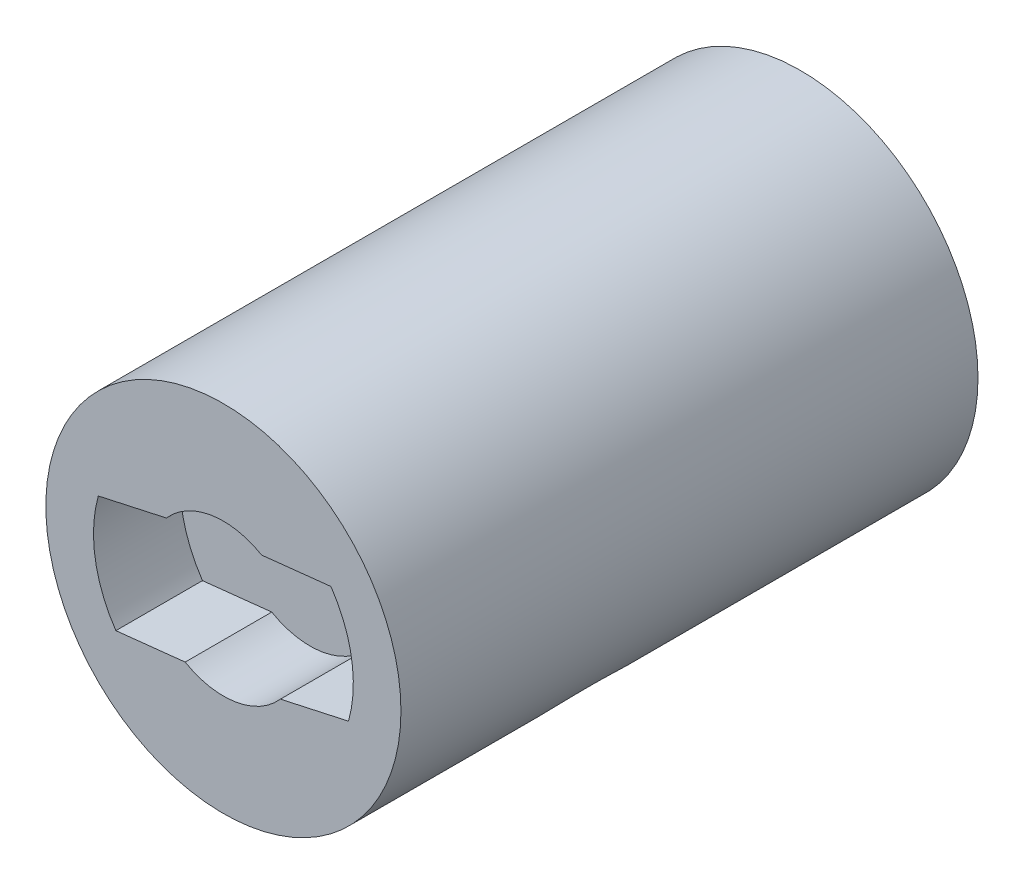
ISO-10303-21;
HEADER;
FILE_DESCRIPTION(('STEP AP214'),'2;1');
FILE_NAME('part.step','',(''),(''),'','','');
FILE_SCHEMA(('AUTOMOTIVE_DESIGN { 1 0 10303 214 1 1 1 1 }'));
ENDSEC;
DATA;
#1=APPLICATION_CONTEXT('core data for automotive mechanical design processes');
#2=APPLICATION_PROTOCOL_DEFINITION('international standard','automotive_design',2000,#1);
#3=PRODUCT_CONTEXT('',#1,'mechanical');
#4=PRODUCT('Part','Part','',(#3));
#5=PRODUCT_RELATED_PRODUCT_CATEGORY('part','',(#4));
#6=PRODUCT_DEFINITION_FORMATION('','',#4);
#7=PRODUCT_DEFINITION_CONTEXT('part definition',#1,'design');
#8=PRODUCT_DEFINITION('design','',#6,#7);
#9=PRODUCT_DEFINITION_SHAPE('','',#8);
#10=(LENGTH_UNIT() NAMED_UNIT(*) SI_UNIT(.MILLI.,.METRE.));
#11=(NAMED_UNIT(*) PLANE_ANGLE_UNIT() SI_UNIT($,.RADIAN.));
#12=(NAMED_UNIT(*) SI_UNIT($,.STERADIAN.) SOLID_ANGLE_UNIT());
#13=UNCERTAINTY_MEASURE_WITH_UNIT(LENGTH_MEASURE(1.E-05),#10,'distance_accuracy_value','');
#14=(GEOMETRIC_REPRESENTATION_CONTEXT(3) GLOBAL_UNCERTAINTY_ASSIGNED_CONTEXT((#13)) GLOBAL_UNIT_ASSIGNED_CONTEXT((#10,
#11,#12)) REPRESENTATION_CONTEXT('',''));
#15=CARTESIAN_POINT('',(0.,0.,0.));
#16=DIRECTION('',(0.,0.,1.));
#17=DIRECTION('',(1.,0.,0.));
#18=AXIS2_PLACEMENT_3D('',#15,#16,#17);
#19=CARTESIAN_POINT('',(0.,0.,26.65));
#20=DIRECTION('',(0.,0.,-1.));
#21=DIRECTION('',(-1.,0.,0.));
#22=AXIS2_PLACEMENT_3D('',#19,#20,#21);
#23=CYLINDRICAL_SURFACE('',#22,8.2);
#24=CARTESIAN_POINT('',(0.,-8.2,22.25));
#25=CARTESIAN_POINT('',(0.15207240943795,-8.19999954792853,22.2499995326064));
#26=CARTESIAN_POINT('',(0.30415176714083,-8.1957606064679,22.2444410540027));
#27=CARTESIAN_POINT('',(0.607097631520944,-8.1789034982446,22.2222996805101));
#28=CARTESIAN_POINT('',(0.757963568944236,-8.16628160717114,22.2057118855999));
#29=CARTESIAN_POINT('',(1.05742056670107,-8.13293249924799,22.1617607942547));
#30=CARTESIAN_POINT('',(1.20600813579783,-8.11219392764066,22.1343824020317));
#31=CARTESIAN_POINT('',(1.49966587575886,-8.06307510113337,22.0692780386894));
#32=CARTESIAN_POINT('',(1.64473446647066,-8.03469148011223,22.0315475093791));
#33=CARTESIAN_POINT('',(1.92944733911106,-7.97109576596842,21.9465669241785));
#34=CARTESIAN_POINT('',(2.06912055366007,-7.93592885894556,21.8993797855473));
#35=CARTESIAN_POINT('',(2.34331893573034,-7.85933555094022,21.7959345656284));
#36=CARTESIAN_POINT('',(2.47784203764071,-7.81790667069163,21.7396728909186));
#37=CARTESIAN_POINT('',(2.87259268776154,-7.68538052883103,21.5582768026148));
#38=CARTESIAN_POINT('',(3.12432748262662,-7.58596836000395,21.4204321600938));
#39=CARTESIAN_POINT('',(3.6240317320613,-7.36128140873211,21.1014679853548));
#40=CARTESIAN_POINT('',(3.86945750051817,-7.2344588642798,20.9175104630975));
#41=CARTESIAN_POINT('',(4.32809144808219,-6.96977258600071,20.5191304380454));
#42=CARTESIAN_POINT('',(4.54125102714886,-6.83189266586798,20.3046629045619));
#43=CARTESIAN_POINT('',(4.85631076880608,-6.60889459824286,19.9385142783027));
#44=CARTESIAN_POINT('',(4.96891350944167,-6.52443515642756,19.7954699450571));
#45=CARTESIAN_POINT('',(5.18161323613211,-6.35682280931943,19.4995150990882));
#46=CARTESIAN_POINT('',(5.28170635571986,-6.27367031488554,19.3466015580312));
#47=CARTESIAN_POINT('',(5.46881333541151,-6.11125303504383,19.0311979385561));
#48=CARTESIAN_POINT('',(5.55583882977753,-6.03198483427953,18.8687165601185));
#49=CARTESIAN_POINT('',(5.71617077204758,-5.88026934168507,18.5342270364932));
#50=CARTESIAN_POINT('',(5.78948507097844,-5.80781815831571,18.3622244167458));
#51=CARTESIAN_POINT('',(5.94111269323296,-5.65315307666194,17.9558962214453));
#52=CARTESIAN_POINT('',(6.01442974417624,-5.57444258488535,17.7182473924686));
#53=CARTESIAN_POINT('',(6.10338369430488,-5.47637318985903,17.3516722556073));
#54=CARTESIAN_POINT('',(6.12952216296965,-5.44702755500472,17.2278729809812));
#55=CARTESIAN_POINT('',(6.17441149032549,-5.39609084647169,16.9773972243255));
#56=CARTESIAN_POINT('',(6.1931662310493,-5.37449569846417,16.850722291341));
#57=CARTESIAN_POINT('',(6.22307192154754,-5.33984190723959,16.593934042489));
#58=CARTESIAN_POINT('',(6.23414096164082,-5.32687528062269,16.4637985893017));
#59=CARTESIAN_POINT('',(6.24808904956325,-5.31050851296349,16.202485094783));
#60=CARTESIAN_POINT('',(6.25096840570315,-5.30710801179267,16.0713070928859));
#61=CARTESIAN_POINT('',(6.2484596035836,-5.31006201799965,15.8091126451263));
#62=CARTESIAN_POINT('',(6.24306989416547,-5.31641835562129,15.6780962341902));
#63=CARTESIAN_POINT('',(6.22416826284947,-5.33853226654295,15.4174853136025));
#64=CARTESIAN_POINT('',(6.21065629899878,-5.35428988840221,15.2878908112989));
#65=CARTESIAN_POINT('',(6.16251570824301,-5.40977436310698,14.9332705039217));
#66=CARTESIAN_POINT('',(6.11964206402348,-5.45861621863641,14.7107283223776));
#67=CARTESIAN_POINT('',(6.01193821916911,-5.57699702233773,14.2768374051819));
#68=CARTESIAN_POINT('',(5.9470852604164,-5.64655741409391,14.0655005352496));
#69=CARTESIAN_POINT('',(5.81093785930049,-5.78625699320936,13.6918129656489));
#70=CARTESIAN_POINT('',(5.74281801885289,-5.85411217780771,13.5274150431297));
#71=CARTESIAN_POINT('',(5.59411549879377,-5.99637044617399,13.2072323159294));
#72=CARTESIAN_POINT('',(5.51352610059914,-6.07077705047013,13.0514522163111));
#73=CARTESIAN_POINT('',(5.3403702702425,-6.22364988437177,12.7483111986112));
#74=CARTESIAN_POINT('',(5.24777880919027,-6.30212438589883,12.6009688291602));
#75=CARTESIAN_POINT('',(5.05117566429857,-6.46077249365511,12.3151384023431));
#76=CARTESIAN_POINT('',(4.94716585339579,-6.54094581949259,12.1766488987325));
#77=CARTESIAN_POINT('',(4.72469664541101,-6.70349045932973,11.9046957616381));
#78=CARTESIAN_POINT('',(4.60589871692113,-6.78585598271882,11.7715053643385));
#79=CARTESIAN_POINT('',(4.35663140803743,-6.94851891245478,11.515111035778));
#80=CARTESIAN_POINT('',(4.22616084680314,-7.02881610850246,11.3919081172907));
#81=CARTESIAN_POINT('',(3.95400328962919,-7.18543430335675,11.1563769688712));
#82=CARTESIAN_POINT('',(3.81233681597405,-7.26176217074497,11.0440296440465));
#83=CARTESIAN_POINT('',(3.51784587452043,-7.4089031762104,10.8308322471403));
#84=CARTESIAN_POINT('',(3.36502042340106,-7.47971582715177,10.7299831902883));
#85=CARTESIAN_POINT('',(3.07875259210313,-7.60135999362749,10.5588539485466));
#86=CARTESIAN_POINT('',(2.94713190504797,-7.65343382576303,10.4864038268094));
#87=CARTESIAN_POINT('',(2.67732507603579,-7.75193808379696,10.3504656234087));
#88=CARTESIAN_POINT('',(2.53914027913725,-7.79836965897692,10.2869757161964));
#89=CARTESIAN_POINT('',(2.25676639811907,-7.88471929521927,10.1696591269519));
#90=CARTESIAN_POINT('',(2.11257800366784,-7.92463810186449,10.115831338728));
#91=CARTESIAN_POINT('',(1.8189996704779,-7.99712992183176,10.0185588160068));
#92=CARTESIAN_POINT('',(1.66961192813028,-8.02970599453324,9.97510975671808));
#93=CARTESIAN_POINT('',(1.3654704218416,-8.08700198983024,9.89895620530778));
#94=CARTESIAN_POINT('',(1.2106861634064,-8.11166468013989,9.86632993237618));
#95=CARTESIAN_POINT('',(0.897957716572402,-8.15221004230744,9.81280885635111));
#96=CARTESIAN_POINT('',(0.740013517079047,-8.168092683333,9.79191409445445));
#97=CARTESIAN_POINT('',(0.422403255466232,-8.1906599365015,9.76225177254438));
#98=CARTESIAN_POINT('',(0.262737976248936,-8.19734856656097,9.75347891507364));
#99=CARTESIAN_POINT('',(-0.056904763303433,-8.20135969627796,9.74821589223887));
#100=CARTESIAN_POINT('',(-0.21688219297588,-8.19868307374172,9.75172457572457));
#101=CARTESIAN_POINT('',(-0.518009077367297,-8.18485266817981,9.76988432167628));
#102=CARTESIAN_POINT('',(-0.659282996368986,-8.17466975240149,9.78325939227514));
#103=CARTESIAN_POINT('',(-0.939958121925078,-8.14716923241113,9.81946559075498));
#104=CARTESIAN_POINT('',(-1.07935869371065,-8.12984926982501,9.84229984435267));
#105=CARTESIAN_POINT('',(-1.35528146304295,-8.08842829935026,9.8970913897884));
#106=CARTESIAN_POINT('',(-1.49180441258411,-8.06432908726929,9.92904626562723));
#107=CARTESIAN_POINT('',(-1.76126464109105,-8.0097973816356,10.0016728221608));
#108=CARTESIAN_POINT('',(-1.89420050535946,-7.97936242942967,10.0423478870036));
#109=CARTESIAN_POINT('',(-2.1588606387946,-7.91191521923912,10.1329869645835));
#110=CARTESIAN_POINT('',(-2.2904822363368,-7.874764661783,10.1831475795288));
#111=CARTESIAN_POINT('',(-2.5486748971823,-7.79503298383987,10.2915516325981));
#112=CARTESIAN_POINT('',(-2.67524414417756,-7.75244993306144,10.3497979444101));
#113=CARTESIAN_POINT('',(-3.04658573143373,-7.61758157893115,10.5358090342085));
#114=CARTESIAN_POINT('',(-3.28318959388218,-7.51812514046653,10.6749147516245));
#115=CARTESIAN_POINT('',(-3.76874477871057,-7.28835671822497,11.0041241397968));
#116=CARTESIAN_POINT('',(-4.01338951759747,-7.1556585584389,11.1988474043563));
#117=CARTESIAN_POINT('',(-4.46880362830258,-6.8804519902013,11.6195187543304));
#118=CARTESIAN_POINT('',(-4.67950489004359,-6.73792465697187,11.8455279694442));
#119=CARTESIAN_POINT('',(-4.98829326090446,-6.50982041480491,12.2299008233284));
#120=CARTESIAN_POINT('',(-5.09776571712347,-6.42421471581815,12.3792663435512));
#121=CARTESIAN_POINT('',(-5.30363702954645,-6.2553286867354,12.68814244439));
#122=CARTESIAN_POINT('',(-5.40003124785828,-6.17204918984368,12.8476565946768));
#123=CARTESIAN_POINT('',(-5.57897595598878,-6.0107830280601,13.1764417180555));
#124=CARTESIAN_POINT('',(-5.66154979878781,-5.93278756999914,13.3456955694582));
#125=CARTESIAN_POINT('',(-5.81212041728476,-5.7853561309765,13.693972613483));
#126=CARTESIAN_POINT('',(-5.88012788743993,-5.71591388637558,13.8729885169322));
#127=CARTESIAN_POINT('',(-6.01455165257637,-5.57465899726725,14.2840179885836));
#128=CARTESIAN_POINT('',(-6.07684400012584,-5.50611912325307,14.5186051330798));
#129=CARTESIAN_POINT('',(-6.1498680258493,-5.42406257362506,14.878990864815));
#130=CARTESIAN_POINT('',(-6.17080016521989,-5.40017781118479,15.0004575875784));
#131=CARTESIAN_POINT('',(-6.20554310042572,-5.36021843536257,15.2456531928935));
#132=CARTESIAN_POINT('',(-6.21935730632486,-5.34414008229475,15.3693809627474));
#133=CARTESIAN_POINT('',(-6.23966086379175,-5.32042115124538,15.6192500385816));
#134=CARTESIAN_POINT('',(-6.24609092294304,-5.31284888493682,15.7454027232386));
#135=CARTESIAN_POINT('',(-6.25127683528396,-5.30674617039611,15.9980838934027));
#136=CARTESIAN_POINT('',(-6.25003298355072,-5.30821537450146,16.124612364273));
#137=CARTESIAN_POINT('',(-6.23989808465676,-5.32012513140517,16.3770069323374));
#138=CARTESIAN_POINT('',(-6.23100252700608,-5.33057097570579,16.5028725947843));
#139=CARTESIAN_POINT('',(-6.2057587565324,-5.35993737510674,16.7529015837662));
#140=CARTESIAN_POINT('',(-6.18940667703354,-5.37886232706907,16.8770639926038));
#141=CARTESIAN_POINT('',(-6.14661838391036,-5.42773313952714,17.1410606256073));
#142=CARTESIAN_POINT('',(-6.11904524465275,-5.45889830008105,17.2804839246262));
#143=CARTESIAN_POINT('',(-6.05507758801939,-5.52976555220034,17.5551347530032));
#144=CARTESIAN_POINT('',(-6.01867675225451,-5.56947375610783,17.6903591984961));
#145=CARTESIAN_POINT('',(-5.93756873183039,-5.65586338449507,17.9563096951005));
#146=CARTESIAN_POINT('',(-5.89284446303397,-5.70255911177304,18.087025826597));
#147=CARTESIAN_POINT('',(-5.79567164193381,-5.80129203768101,18.3433907750295));
#148=CARTESIAN_POINT('',(-5.74322516519117,-5.85332779989077,18.4690409420625));
#149=CARTESIAN_POINT('',(-5.60860696738024,-5.98292420448691,18.7643926894787));
#150=CARTESIAN_POINT('',(-5.52292439188348,-6.06238514647736,18.9316672140658));
#151=CARTESIAN_POINT('',(-5.33800651642176,-6.2258278982434,19.2562387175115));
#152=CARTESIAN_POINT('',(-5.23876620677292,-6.30981137214617,19.4135319766069));
#153=CARTESIAN_POINT('',(-5.02713518651051,-6.47968699978867,19.7181766968851));
#154=CARTESIAN_POINT('',(-4.91473176995548,-6.5655809317778,19.8655183321819));
#155=CARTESIAN_POINT('',(-4.67717224980978,-6.73687663357016,20.149803076066));
#156=CARTESIAN_POINT('',(-4.55201786011599,-6.82227846789159,20.2867475778563));
#157=CARTESIAN_POINT('',(-4.28699499583996,-6.9919120024041,20.5519096114741));
#158=CARTESIAN_POINT('',(-4.14691862815702,-7.07610145144818,20.6799468846815));
#159=CARTESIAN_POINT('',(-3.85401932186344,-7.23979851751302,20.9239581501599));
#160=CARTESIAN_POINT('',(-3.70119470526803,-7.31930551585038,21.0399305498664));
#161=CARTESIAN_POINT('',(-3.38350521523068,-7.47146955317145,21.2584687030943));
#162=CARTESIAN_POINT('',(-3.21866325149531,-7.54413905080029,21.3610589774723));
#163=CARTESIAN_POINT('',(-2.8773945239955,-7.68077735722868,21.5516895137316));
#164=CARTESIAN_POINT('',(-2.70097311977667,-7.74475014977333,21.6397364415613));
#165=CARTESIAN_POINT('',(-2.38801357712437,-7.84579180860112,21.7775851179418));
#166=CARTESIAN_POINT('',(-2.25397210666585,-7.88540335795816,21.831223626562));
#167=CARTESIAN_POINT('',(-1.98099337550176,-7.95836725928132,21.929519010308));
#168=CARTESIAN_POINT('',(-1.84205728650064,-7.99172109732588,21.9741780180626));
#169=CARTESIAN_POINT('',(-1.56029450320198,-8.05147067926163,22.0538726296498));
#170=CARTESIAN_POINT('',(-1.41747613051905,-8.07788018237702,22.0889272690648));
#171=CARTESIAN_POINT('',(-1.12863415576797,-8.12327170316123,22.1490187357856));
#172=CARTESIAN_POINT('',(-0.982611846980988,-8.14225666157548,22.1740595295073));
#173=CARTESIAN_POINT('',(-0.697560742510614,-8.17145245591191,22.2125100487197));
#174=CARTESIAN_POINT('',(-0.558665248603107,-8.18213751262061,22.2265488978838));
#175=CARTESIAN_POINT('',(-0.279848617745579,-8.19641231627377,22.2452951717507));
#176=CARTESIAN_POINT('',(-0.139927250245909,-8.20000041596708,22.2500004300655));
#177=CARTESIAN_POINT('',(0.,-8.2,22.25));
#178=B_SPLINE_CURVE_WITH_KNOTS('',3,(#24,#25,#26,#27,#28,#29,#30,#31,#32,#33,#34,#35,#36,#37,
#38,#39,#40,#41,#42,#43,#44,#45,#46,#47,#48,#49,#50,#51,#52,#53,#54,#55,#56,#57,#58,#59,#60,#61,
#62,#63,#64,#65,#66,#67,#68,#69,#70,#71,#72,#73,#74,#75,#76,#77,#78,#79,#80,#81,#82,#83,#84,#85,
#86,#87,#88,#89,#90,#91,#92,#93,#94,#95,#96,#97,#98,#99,#100,#101,#102,#103,#104,#105,#106,#107,
#108,#109,#110,#111,#112,#113,#114,#115,#116,#117,#118,#119,#120,#121,#122,#123,#124,#125,#126,
#127,#128,#129,#130,#131,#132,#133,#134,#135,#136,#137,#138,#139,#140,#141,#142,#143,#144,#145,
#146,#147,#148,#149,#150,#151,#152,#153,#154,#155,#156,#157,#158,#159,#160,#161,#162,#163,#164,
#165,#166,#167,#168,#169,#170,#171,#172,#173,#174,#175,#176,#177),.UNSPECIFIED.,.T.,.F.,(4,2,2,
2,2,2,2,2,2,2,2,2,2,2,2,2,2,2,2,2,2,2,2,2,2,2,2,2,2,2,2,2,2,2,2,2,2,2,2,2,2,2,2,2,2,2,2,2,2,2,2,
2,2,2,2,2,2,2,2,2,2,2,2,2,2,2,2,2,2,2,2,2,2,2,2,2,4),(0.,0.456070263243954,0.912343281448502,
1.369256893442,1.82637201465453,2.28054118155803,2.73489063828808,3.64255432779434,
4.63492193116024,5.62876969714563,6.23027969517241,6.83197515022093,7.43313169128019,
8.03394294923894,8.81341322102126,9.20268884762506,9.59175953638615,9.98491557275259,
10.3780568080801,10.7712718001105,11.1644888231806,11.8571599293246,12.5505504527301,
13.121147635037,13.6920533319289,14.2641693380646,14.8361916405955,15.4252809202739,
16.0144298616201,16.6025228736943,17.1906677707786,17.6672557340328,18.1437464569148,
18.6201825927257,19.0964198510591,19.5760275992984,20.0556370317355,20.5350368011658,
21.0143916376029,21.4407006596357,21.8671506648273,22.2934878105933,22.7199907105931,
23.1565612449839,23.5932873373791,24.4660988512473,25.4816209482464,26.4991560448203,
27.1106241354931,27.7223085054245,28.3329486118241,28.9431388450013,29.6966202518605,
30.0728861976914,30.4489717138061,30.8280564177573,31.2071265452397,31.5864202783681,
31.9659109232362,32.4017582418175,32.8379184419085,33.2749839520701,33.7119322022727,
34.3232223183757,34.934738924769,35.5468507517932,36.1588804112908,36.7809614161039,
37.4031244317521,38.0241309092487,38.6448519535642,39.0935507454571,39.5421428453137,
39.9898393088243,40.4373582667703,40.8569074209631,41.276553943896),.UNSPECIFIED.);
#179=CARTESIAN_POINT('',(0.,-8.2,22.25));
#180=VERTEX_POINT('',#179);
#181=EDGE_CURVE('E42',#180,#180,#178,.T.);
#182=ORIENTED_EDGE('',*,*,#181,.T.);
#183=EDGE_LOOP('',(#182));
#184=FACE_BOUND('',#183,.T.);
#185=CARTESIAN_POINT('',(0.,0.,26.65));
#186=DIRECTION('',(0.,0.,1.));
#187=DIRECTION('',(1.,0.,0.));
#188=AXIS2_PLACEMENT_3D('',#185,#186,#187);
#189=CIRCLE('',#188,8.2);
#190=CARTESIAN_POINT('',(8.2,0.,26.65));
#191=VERTEX_POINT('',#190);
#192=EDGE_CURVE('E52',#191,#191,#189,.T.);
#193=ORIENTED_EDGE('',*,*,#192,.F.);
#194=EDGE_LOOP('',(#193));
#195=FACE_BOUND('',#194,.T.);
#196=CARTESIAN_POINT('',(0.,0.,0.));
#197=DIRECTION('',(0.,0.,1.));
#198=DIRECTION('',(1.,0.,0.));
#199=AXIS2_PLACEMENT_3D('',#196,#197,#198);
#200=CIRCLE('',#199,8.2);
#201=CARTESIAN_POINT('',(8.2,0.,0.));
#202=VERTEX_POINT('',#201);
#203=EDGE_CURVE('E192',#202,#202,#200,.T.);
#204=ORIENTED_EDGE('',*,*,#203,.T.);
#205=EDGE_LOOP('',(#204));
#206=FACE_BOUND('',#205,.T.);
#207=ADVANCED_FACE('F38',(#184,#195,#206),#23,.T.);
#208=CARTESIAN_POINT('',(0.,0.,26.65));
#209=DIRECTION('',(0.,0.,1.));
#210=DIRECTION('',(1.,0.,0.));
#211=AXIS2_PLACEMENT_3D('',#208,#209,#210);
#212=PLANE('',#211);
#213=DIRECTION('',(0.994278917809091,0.106814950266258,0.));
#214=VECTOR('',#213,1.);
#215=CARTESIAN_POINT('',(0.300853046860838,-2.80046792239021,26.65));
#216=LINE('',#215,#214);
#217=CARTESIAN_POINT('',(-4.96665488441464,-3.36635400086215,26.65));
#218=VERTEX_POINT('',#217);
#219=CARTESIAN_POINT('',(-1.76496733595539,-3.02239810465314,26.65));
#220=VERTEX_POINT('',#219);
#221=EDGE_CURVE('E59',#218,#220,#216,.T.);
#222=ORIENTED_EDGE('',*,*,#221,.F.);
#223=CARTESIAN_POINT('',(0.,0.,26.65));
#224=DIRECTION('',(0.,0.,1.));
#225=DIRECTION('',(1.,0.,0.));
#226=AXIS2_PLACEMENT_3D('',#223,#224,#225);
#227=CIRCLE('',#226,6.);
#228=CARTESIAN_POINT('',(-5.77868680938875,1.61455218528138,26.65));
#229=VERTEX_POINT('',#228);
#230=EDGE_CURVE('E163',#229,#218,#227,.T.);
#231=ORIENTED_EDGE('',*,*,#230,.F.);
#232=DIRECTION('',(-0.976720682768051,-0.214515052742489,0.));
#233=VECTOR('',#232,1.);
#234=CARTESIAN_POINT('',(-0.60419919734285,2.75101371680911,26.65));
#235=LINE('',#234,#233);
#236=CARTESIAN_POINT('',(-2.63353871026998,2.3053142652379,26.65));
#237=VERTEX_POINT('',#236);
#238=EDGE_CURVE('E169',#237,#229,#235,.T.);
#239=ORIENTED_EDGE('',*,*,#238,.F.);
#240=CARTESIAN_POINT('',(0.,0.,26.65));
#241=DIRECTION('',(0.,0.,1.));
#242=DIRECTION('',(1.,0.,0.));
#243=AXIS2_PLACEMENT_3D('',#240,#241,#242);
#244=CIRCLE('',#243,3.49999999999997);
#245=CARTESIAN_POINT('',(1.7649673359554,3.02239810465305,26.65));
#246=VERTEX_POINT('',#245);
#247=EDGE_CURVE('E119',#246,#237,#244,.T.);
#248=ORIENTED_EDGE('',*,*,#247,.F.);
#249=DIRECTION('',(-0.994278917809091,-0.106814950266258,0.));
#250=VECTOR('',#249,1.);
#251=CARTESIAN_POINT('',(-0.30085304686083,2.80046792239014,26.65));
#252=LINE('',#251,#250);
#253=CARTESIAN_POINT('',(4.96665488441461,3.36635400086208,26.65));
#254=VERTEX_POINT('',#253);
#255=EDGE_CURVE('E162',#254,#246,#252,.T.);
#256=ORIENTED_EDGE('',*,*,#255,.F.);
#257=CARTESIAN_POINT('',(5.77868680938865,-1.61455218528148,26.65));
#258=VERTEX_POINT('',#257);
#259=EDGE_CURVE('E158',#258,#254,#227,.T.);
#260=ORIENTED_EDGE('',*,*,#259,.F.);
#261=DIRECTION('',(0.976720682768051,0.214515052742489,0.));
#262=VECTOR('',#261,1.);
#263=CARTESIAN_POINT('',(0.604199197342865,-2.75101371680918,26.65));
#264=LINE('',#263,#262);
#265=CARTESIAN_POINT('',(2.63353871027,-2.30531426523797,26.65));
#266=VERTEX_POINT('',#265);
#267=EDGE_CURVE('E155',#266,#258,#264,.T.);
#268=ORIENTED_EDGE('',*,*,#267,.F.);
#269=CARTESIAN_POINT('',(0.,0.,26.65));
#270=DIRECTION('',(0.,0.,1.));
#271=DIRECTION('',(1.,0.,0.));
#272=AXIS2_PLACEMENT_3D('',#269,#270,#271);
#273=CIRCLE('',#272,3.50000000000003);
#274=EDGE_CURVE('E151',#220,#266,#273,.T.);
#275=ORIENTED_EDGE('',*,*,#274,.F.);
#276=EDGE_LOOP('',(#222,#231,#239,#248,#256,#260,#268,#275));
#277=FACE_BOUND('',#276,.T.);
#278=ORIENTED_EDGE('',*,*,#192,.T.);
#279=EDGE_LOOP('',(#278));
#280=FACE_BOUND('',#279,.T.);
#281=ADVANCED_FACE('F204',(#277,#280),#212,.T.);
#282=CARTESIAN_POINT('',(0.,0.,0.));
#283=DIRECTION('',(0.,0.,1.));
#284=DIRECTION('',(1.,0.,0.));
#285=AXIS2_PLACEMENT_3D('',#282,#283,#284);
#286=PLANE('',#285);
#287=CARTESIAN_POINT('',(0.,0.,0.));
#288=DIRECTION('',(0.,0.,1.));
#289=DIRECTION('',(1.,0.,0.));
#290=AXIS2_PLACEMENT_3D('',#287,#288,#289);
#291=CIRCLE('',#290,5.);
#292=CARTESIAN_POINT('',(5.,0.,0.));
#293=VERTEX_POINT('',#292);
#294=EDGE_CURVE('E11',#293,#293,#291,.F.);
#295=ORIENTED_EDGE('',*,*,#294,.F.);
#296=EDGE_LOOP('',(#295));
#297=FACE_BOUND('',#296,.T.);
#298=ORIENTED_EDGE('',*,*,#203,.F.);
#299=EDGE_LOOP('',(#298));
#300=FACE_BOUND('',#299,.T.);
#301=ADVANCED_FACE('F201',(#297,#300),#286,.F.);
#302=CARTESIAN_POINT('',(0.,0.,-1.5));
#303=DIRECTION('',(0.,0.,1.));
#304=DIRECTION('',(1.,0.,0.));
#305=AXIS2_PLACEMENT_3D('',#302,#303,#304);
#306=CYLINDRICAL_SURFACE('',#305,5.);
#307=CARTESIAN_POINT('',(0.,0.,-1.5));
#308=DIRECTION('',(0.,0.,-1.));
#309=DIRECTION('',(-1.,0.,0.));
#310=AXIS2_PLACEMENT_3D('',#307,#308,#309);
#311=CIRCLE('',#310,5.);
#312=CARTESIAN_POINT('',(-5.,0.,-1.5));
#313=VERTEX_POINT('',#312);
#314=EDGE_CURVE('E173',#313,#313,#311,.T.);
#315=ORIENTED_EDGE('',*,*,#314,.F.);
#316=EDGE_LOOP('',(#315));
#317=FACE_BOUND('',#316,.T.);
#318=ORIENTED_EDGE('',*,*,#294,.T.);
#319=EDGE_LOOP('',(#318));
#320=FACE_BOUND('',#319,.T.);
#321=ADVANCED_FACE('F203',(#317,#320),#306,.T.);
#322=CARTESIAN_POINT('',(0.,0.,-1.5));
#323=DIRECTION('',(0.,0.,-1.));
#324=DIRECTION('',(-1.,0.,0.));
#325=AXIS2_PLACEMENT_3D('',#322,#323,#324);
#326=PLANE('',#325);
#327=ORIENTED_EDGE('',*,*,#314,.T.);
#328=EDGE_LOOP('',(#327));
#329=FACE_BOUND('',#328,.T.);
#330=ADVANCED_FACE('F210',(#329),#326,.T.);
#331=CARTESIAN_POINT('',(0.300853046860838,-2.80046792239021,22.65));
#332=DIRECTION('',(0.106814950266258,-0.994278917809091,0.));
#333=DIRECTION('',(0.994278917809091,0.106814950266258,0.));
#334=AXIS2_PLACEMENT_3D('',#331,#332,#333);
#335=PLANE('',#334);
#336=ORIENTED_EDGE('',*,*,#221,.T.);
#337=DIRECTION('',(0.,0.,1.));
#338=VECTOR('',#337,1.);
#339=CARTESIAN_POINT('',(-1.76496733595537,-3.02239810465312,22.65));
#340=LINE('',#339,#338);
#341=CARTESIAN_POINT('',(-1.76496733595537,-3.02239810465312,22.65));
#342=VERTEX_POINT('',#341);
#343=EDGE_CURVE('E95',#342,#220,#340,.T.);
#344=ORIENTED_EDGE('',*,*,#343,.F.);
#345=DIRECTION('',(0.994278917809091,0.106814950266258,0.));
#346=VECTOR('',#345,1.);
#347=CARTESIAN_POINT('',(0.300853046860838,-2.80046792239021,22.65));
#348=LINE('',#347,#346);
#349=CARTESIAN_POINT('',(-4.96665488441464,-3.36635400086215,22.65));
#350=VERTEX_POINT('',#349);
#351=EDGE_CURVE('E235',#350,#342,#348,.T.);
#352=ORIENTED_EDGE('',*,*,#351,.F.);
#353=DIRECTION('',(0.,0.,1.));
#354=VECTOR('',#353,1.);
#355=CARTESIAN_POINT('',(-4.96665488441464,-3.36635400086215,22.65));
#356=LINE('',#355,#354);
#357=EDGE_CURVE('E67',#350,#218,#356,.T.);
#358=ORIENTED_EDGE('',*,*,#357,.T.);
#359=EDGE_LOOP('',(#336,#344,#352,#358));
#360=FACE_BOUND('',#359,.T.);
#361=ADVANCED_FACE('F277',(#360),#335,.F.);
#362=CARTESIAN_POINT('',(0.,0.,22.65));
#363=DIRECTION('',(0.,0.,1.));
#364=DIRECTION('',(1.,0.,0.));
#365=AXIS2_PLACEMENT_3D('',#362,#363,#364);
#366=CYLINDRICAL_SURFACE('',#365,6.);
#367=ORIENTED_EDGE('',*,*,#230,.T.);
#368=ORIENTED_EDGE('',*,*,#357,.F.);
#369=CARTESIAN_POINT('',(0.,0.,22.65));
#370=DIRECTION('',(0.,0.,1.));
#371=DIRECTION('',(1.,0.,0.));
#372=AXIS2_PLACEMENT_3D('',#369,#370,#371);
#373=CIRCLE('',#372,6.);
#374=CARTESIAN_POINT('',(-5.77868680938875,1.61455218528138,22.65));
#375=VERTEX_POINT('',#374);
#376=EDGE_CURVE('E133',#375,#350,#373,.T.);
#377=ORIENTED_EDGE('',*,*,#376,.F.);
#378=DIRECTION('',(0.,0.,1.));
#379=VECTOR('',#378,1.);
#380=CARTESIAN_POINT('',(-5.77868680938875,1.61455218528138,22.65));
#381=LINE('',#380,#379);
#382=EDGE_CURVE('E124',#375,#229,#381,.T.);
#383=ORIENTED_EDGE('',*,*,#382,.T.);
#384=EDGE_LOOP('',(#367,#368,#377,#383));
#385=FACE_BOUND('',#384,.T.);
#386=ADVANCED_FACE('F248',(#385),#366,.F.);
#387=CARTESIAN_POINT('',(-0.60419919734285,2.75101371680911,22.65));
#388=DIRECTION('',(-0.214515052742489,0.976720682768051,0.));
#389=DIRECTION('',(-0.976720682768051,-0.214515052742489,0.));
#390=AXIS2_PLACEMENT_3D('',#387,#388,#389);
#391=PLANE('',#390);
#392=ORIENTED_EDGE('',*,*,#238,.T.);
#393=ORIENTED_EDGE('',*,*,#382,.F.);
#394=DIRECTION('',(-0.976720682768051,-0.214515052742489,0.));
#395=VECTOR('',#394,1.);
#396=CARTESIAN_POINT('',(-0.60419919734285,2.75101371680911,22.65));
#397=LINE('',#396,#395);
#398=CARTESIAN_POINT('',(-2.63353871026998,2.3053142652379,22.65));
#399=VERTEX_POINT('',#398);
#400=EDGE_CURVE('E128',#399,#375,#397,.T.);
#401=ORIENTED_EDGE('',*,*,#400,.F.);
#402=DIRECTION('',(0.,0.,1.));
#403=VECTOR('',#402,1.);
#404=CARTESIAN_POINT('',(-2.63353871026998,2.3053142652379,22.65));
#405=LINE('',#404,#403);
#406=EDGE_CURVE('E112',#399,#237,#405,.T.);
#407=ORIENTED_EDGE('',*,*,#406,.T.);
#408=EDGE_LOOP('',(#392,#393,#401,#407));
#409=FACE_BOUND('',#408,.T.);
#410=ADVANCED_FACE('F129',(#409),#391,.F.);
#411=CARTESIAN_POINT('',(0.,0.,22.65));
#412=DIRECTION('',(0.,0.,1.));
#413=DIRECTION('',(1.,0.,0.));
#414=AXIS2_PLACEMENT_3D('',#411,#412,#413);
#415=CYLINDRICAL_SURFACE('',#414,3.49999999999997);
#416=ORIENTED_EDGE('',*,*,#247,.T.);
#417=ORIENTED_EDGE('',*,*,#406,.F.);
#418=CARTESIAN_POINT('',(0.,0.,22.65));
#419=DIRECTION('',(0.,0.,1.));
#420=DIRECTION('',(1.,0.,0.));
#421=AXIS2_PLACEMENT_3D('',#418,#419,#420);
#422=CIRCLE('',#421,3.49999999999997);
#423=CARTESIAN_POINT('',(1.7649673359554,3.02239810465305,22.65));
#424=VERTEX_POINT('',#423);
#425=EDGE_CURVE('E116',#424,#399,#422,.T.);
#426=ORIENTED_EDGE('',*,*,#425,.F.);
#427=DIRECTION('',(0.,0.,1.));
#428=VECTOR('',#427,1.);
#429=CARTESIAN_POINT('',(1.7649673359554,3.02239810465305,22.65));
#430=LINE('',#429,#428);
#431=EDGE_CURVE('E125',#424,#246,#430,.T.);
#432=ORIENTED_EDGE('',*,*,#431,.T.);
#433=EDGE_LOOP('',(#416,#417,#426,#432));
#434=FACE_BOUND('',#433,.T.);
#435=ADVANCED_FACE('F114',(#434),#415,.F.);
#436=CARTESIAN_POINT('',(-0.30085304686083,2.80046792239014,22.65));
#437=DIRECTION('',(-0.106814950266258,0.994278917809091,0.));
#438=DIRECTION('',(-0.994278917809091,-0.106814950266258,0.));
#439=AXIS2_PLACEMENT_3D('',#436,#437,#438);
#440=PLANE('',#439);
#441=ORIENTED_EDGE('',*,*,#255,.T.);
#442=ORIENTED_EDGE('',*,*,#431,.F.);
#443=DIRECTION('',(-0.994278917809091,-0.106814950266258,0.));
#444=VECTOR('',#443,1.);
#445=CARTESIAN_POINT('',(-0.30085304686083,2.80046792239014,22.65));
#446=LINE('',#445,#444);
#447=CARTESIAN_POINT('',(4.96665488441461,3.36635400086208,22.65));
#448=VERTEX_POINT('',#447);
#449=EDGE_CURVE('E139',#448,#424,#446,.T.);
#450=ORIENTED_EDGE('',*,*,#449,.F.);
#451=DIRECTION('',(0.,0.,1.));
#452=VECTOR('',#451,1.);
#453=CARTESIAN_POINT('',(4.96665488441461,3.36635400086208,22.65));
#454=LINE('',#453,#452);
#455=EDGE_CURVE('E178',#448,#254,#454,.T.);
#456=ORIENTED_EDGE('',*,*,#455,.T.);
#457=EDGE_LOOP('',(#441,#442,#450,#456));
#458=FACE_BOUND('',#457,.T.);
#459=ADVANCED_FACE('F262',(#458),#440,.F.);
#460=ORIENTED_EDGE('',*,*,#259,.T.);
#461=ORIENTED_EDGE('',*,*,#455,.F.);
#462=CARTESIAN_POINT('',(5.77868680938865,-1.61455218528148,22.65));
#463=VERTEX_POINT('',#462);
#464=EDGE_CURVE('E145',#463,#448,#373,.T.);
#465=ORIENTED_EDGE('',*,*,#464,.F.);
#466=DIRECTION('',(0.,0.,1.));
#467=VECTOR('',#466,1.);
#468=CARTESIAN_POINT('',(5.77868680938865,-1.61455218528148,22.65));
#469=LINE('',#468,#467);
#470=EDGE_CURVE('E181',#463,#258,#469,.T.);
#471=ORIENTED_EDGE('',*,*,#470,.T.);
#472=EDGE_LOOP('',(#460,#461,#465,#471));
#473=FACE_BOUND('',#472,.T.);
#474=ADVANCED_FACE('F259',(#473),#366,.F.);
#475=CARTESIAN_POINT('',(0.604199197342865,-2.75101371680918,22.65));
#476=DIRECTION('',(0.214515052742489,-0.976720682768051,0.));
#477=DIRECTION('',(0.976720682768051,0.214515052742489,0.));
#478=AXIS2_PLACEMENT_3D('',#475,#476,#477);
#479=PLANE('',#478);
#480=ORIENTED_EDGE('',*,*,#267,.T.);
#481=ORIENTED_EDGE('',*,*,#470,.F.);
#482=DIRECTION('',(0.976720682768051,0.214515052742489,0.));
#483=VECTOR('',#482,1.);
#484=CARTESIAN_POINT('',(0.604199197342865,-2.75101371680918,22.65));
#485=LINE('',#484,#483);
#486=CARTESIAN_POINT('',(2.63353871027,-2.30531426523797,22.65));
#487=VERTEX_POINT('',#486);
#488=EDGE_CURVE('E241',#487,#463,#485,.T.);
#489=ORIENTED_EDGE('',*,*,#488,.F.);
#490=DIRECTION('',(0.,0.,1.));
#491=VECTOR('',#490,1.);
#492=CARTESIAN_POINT('',(2.63353871027,-2.30531426523797,22.65));
#493=LINE('',#492,#491);
#494=EDGE_CURVE('E184',#487,#266,#493,.T.);
#495=ORIENTED_EDGE('',*,*,#494,.T.);
#496=EDGE_LOOP('',(#480,#481,#489,#495));
#497=FACE_BOUND('',#496,.T.);
#498=ADVANCED_FACE('F257',(#497),#479,.F.);
#499=CARTESIAN_POINT('',(0.,0.,22.65));
#500=DIRECTION('',(0.,0.,1.));
#501=DIRECTION('',(1.,0.,0.));
#502=AXIS2_PLACEMENT_3D('',#499,#500,#501);
#503=CYLINDRICAL_SURFACE('',#502,3.50000000000003);
#504=ORIENTED_EDGE('',*,*,#274,.T.);
#505=ORIENTED_EDGE('',*,*,#494,.F.);
#506=CARTESIAN_POINT('',(0.,0.,22.65));
#507=DIRECTION('',(0.,0.,1.));
#508=DIRECTION('',(1.,0.,0.));
#509=AXIS2_PLACEMENT_3D('',#506,#507,#508);
#510=CIRCLE('',#509,3.50000000000003);
#511=EDGE_CURVE('E237',#342,#487,#510,.T.);
#512=ORIENTED_EDGE('',*,*,#511,.F.);
#513=ORIENTED_EDGE('',*,*,#343,.T.);
#514=EDGE_LOOP('',(#504,#505,#512,#513));
#515=FACE_BOUND('',#514,.T.);
#516=ADVANCED_FACE('F254',(#515),#503,.F.);
#517=CARTESIAN_POINT('',(0.,0.,22.65));
#518=DIRECTION('',(0.,0.,1.));
#519=DIRECTION('',(1.,0.,0.));
#520=AXIS2_PLACEMENT_3D('',#517,#518,#519);
#521=PLANE('',#520);
#522=ORIENTED_EDGE('',*,*,#351,.T.);
#523=ORIENTED_EDGE('',*,*,#511,.T.);
#524=ORIENTED_EDGE('',*,*,#488,.T.);
#525=ORIENTED_EDGE('',*,*,#464,.T.);
#526=ORIENTED_EDGE('',*,*,#449,.T.);
#527=ORIENTED_EDGE('',*,*,#425,.T.);
#528=ORIENTED_EDGE('',*,*,#400,.T.);
#529=ORIENTED_EDGE('',*,*,#376,.T.);
#530=EDGE_LOOP('',(#522,#523,#524,#525,#526,#527,#528,#529));
#531=FACE_BOUND('',#530,.T.);
#532=ADVANCED_FACE('F136',(#531),#521,.T.);
#533=CARTESIAN_POINT('',(0.,-11.,16.));
#534=DIRECTION('',(0.,1.,0.));
#535=DIRECTION('',(0.,0.,1.));
#536=AXIS2_PLACEMENT_3D('',#533,#534,#535);
#537=CYLINDRICAL_SURFACE('',#536,6.25);
#538=CARTESIAN_POINT('',(0.,-1.,16.));
#539=DIRECTION('',(0.,1.,0.));
#540=DIRECTION('',(0.,0.,1.));
#541=AXIS2_PLACEMENT_3D('',#538,#539,#540);
#542=CIRCLE('',#541,6.25);
#543=CARTESIAN_POINT('',(0.,-1.,22.25));
#544=VERTEX_POINT('',#543);
#545=EDGE_CURVE('E227',#544,#544,#542,.T.);
#546=ORIENTED_EDGE('',*,*,#545,.T.);
#547=EDGE_LOOP('',(#546));
#548=FACE_BOUND('',#547,.T.);
#549=ORIENTED_EDGE('',*,*,#181,.F.);
#550=EDGE_LOOP('',(#549));
#551=FACE_BOUND('',#550,.T.);
#552=ADVANCED_FACE('F327',(#548,#551),#537,.F.);
#553=CARTESIAN_POINT('',(0.,-1.,0.));
#554=DIRECTION('',(0.,1.,0.));
#555=DIRECTION('',(0.,0.,1.));
#556=AXIS2_PLACEMENT_3D('',#553,#554,#555);
#557=PLANE('',#556);
#558=ORIENTED_EDGE('',*,*,#545,.F.);
#559=EDGE_LOOP('',(#558));
#560=FACE_BOUND('',#559,.T.);
#561=ADVANCED_FACE('F336',(#560),#557,.F.);
#562=CLOSED_SHELL('',(#207,#281,#301,#321,#330,#361,#386,#410,#435,#459,#474,#498,#516,#532,
#552,#561));
#563=MANIFOLD_SOLID_BREP('B2',#562);
#564=ADVANCED_BREP_SHAPE_REPRESENTATION('',(#18,#563),#14);
#565=SHAPE_DEFINITION_REPRESENTATION(#9,#564);
ENDSEC;
END-ISO-10303-21;
